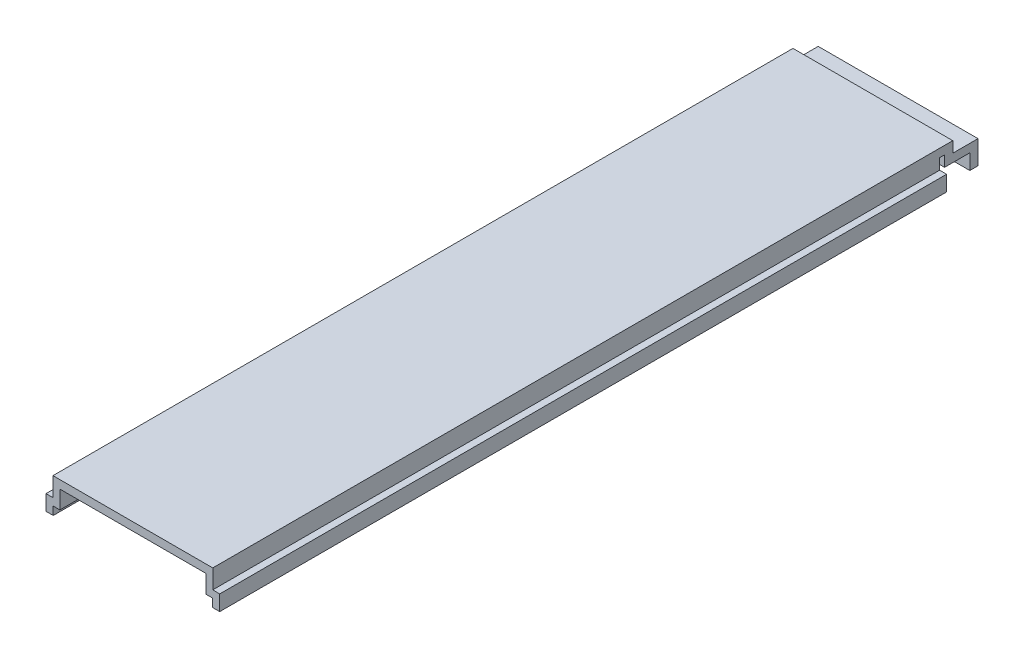
ISO-10303-21;
HEADER;
FILE_DESCRIPTION(('STEP AP214'),'2;1');
FILE_NAME('part.step','',(''),(''),'','','');
FILE_SCHEMA(('AUTOMOTIVE_DESIGN { 1 0 10303 214 1 1 1 1 }'));
ENDSEC;
DATA;
#1=APPLICATION_CONTEXT('core data for automotive mechanical design processes');
#2=APPLICATION_PROTOCOL_DEFINITION('international standard','automotive_design',2000,#1);
#3=PRODUCT_CONTEXT('',#1,'mechanical');
#4=PRODUCT('Part','Part','',(#3));
#5=PRODUCT_RELATED_PRODUCT_CATEGORY('part','',(#4));
#6=PRODUCT_DEFINITION_FORMATION('','',#4);
#7=PRODUCT_DEFINITION_CONTEXT('part definition',#1,'design');
#8=PRODUCT_DEFINITION('design','',#6,#7);
#9=PRODUCT_DEFINITION_SHAPE('','',#8);
#10=(LENGTH_UNIT() NAMED_UNIT(*) SI_UNIT(.MILLI.,.METRE.));
#11=(NAMED_UNIT(*) PLANE_ANGLE_UNIT() SI_UNIT($,.RADIAN.));
#12=(NAMED_UNIT(*) SI_UNIT($,.STERADIAN.) SOLID_ANGLE_UNIT());
#13=UNCERTAINTY_MEASURE_WITH_UNIT(LENGTH_MEASURE(1.E-05),#10,'distance_accuracy_value','');
#14=(GEOMETRIC_REPRESENTATION_CONTEXT(3) GLOBAL_UNCERTAINTY_ASSIGNED_CONTEXT((#13)) GLOBAL_UNIT_ASSIGNED_CONTEXT((#10,
#11,#12)) REPRESENTATION_CONTEXT('',''));
#15=CARTESIAN_POINT('',(0.,0.,0.));
#16=DIRECTION('',(0.,0.,1.));
#17=DIRECTION('',(1.,0.,0.));
#18=AXIS2_PLACEMENT_3D('',#15,#16,#17);
#19=CARTESIAN_POINT('',(0.,0.,0.));
#20=DIRECTION('',(0.,0.,-1.));
#21=DIRECTION('',(-1.,0.,0.));
#22=AXIS2_PLACEMENT_3D('',#19,#20,#21);
#23=PLANE('',#22);
#24=DIRECTION('',(-1.,0.,0.));
#25=VECTOR('',#24,1.);
#26=CARTESIAN_POINT('',(79.6383872683328,20.5122045716546,0.));
#27=LINE('',#26,#25);
#28=CARTESIAN_POINT('',(59.64,20.5122045716546,0.));
#29=VERTEX_POINT('',#28);
#30=CARTESIAN_POINT('',(56.94,20.5122045716546,0.));
#31=VERTEX_POINT('',#30);
#32=EDGE_CURVE('E47',#29,#31,#27,.T.);
#33=ORIENTED_EDGE('',*,*,#32,.F.);
#34=DIRECTION('',(0.,1.,0.));
#35=VECTOR('',#34,1.);
#36=CARTESIAN_POINT('',(59.64,23.6872045716546,0.));
#37=LINE('',#36,#35);
#38=CARTESIAN_POINT('',(59.64,16.298774948689,0.));
#39=VERTEX_POINT('',#38);
#40=EDGE_CURVE('E212',#39,#29,#37,.T.);
#41=ORIENTED_EDGE('',*,*,#40,.F.);
#42=DIRECTION('',(-1.,0.,0.));
#43=VECTOR('',#42,1.);
#44=CARTESIAN_POINT('',(59.64,16.298774948689,0.));
#45=LINE('',#44,#43);
#46=CARTESIAN_POINT('',(62.34,16.298774948689,0.));
#47=VERTEX_POINT('',#46);
#48=EDGE_CURVE('E114',#47,#39,#45,.T.);
#49=ORIENTED_EDGE('',*,*,#48,.F.);
#50=DIRECTION('',(0.,1.,0.));
#51=VECTOR('',#50,1.);
#52=CARTESIAN_POINT('',(62.34,16.298774948689,0.));
#53=LINE('',#52,#51);
#54=CARTESIAN_POINT('',(62.34,10.3372045716546,0.));
#55=VERTEX_POINT('',#54);
#56=EDGE_CURVE('E209',#55,#47,#53,.T.);
#57=ORIENTED_EDGE('',*,*,#56,.F.);
#58=DIRECTION('',(1.,0.,0.));
#59=VECTOR('',#58,1.);
#60=CARTESIAN_POINT('',(59.54,10.3372045716546,0.));
#61=LINE('',#60,#59);
#62=CARTESIAN_POINT('',(59.54,10.3372045716546,0.));
#63=VERTEX_POINT('',#62);
#64=EDGE_CURVE('E207',#63,#55,#61,.T.);
#65=ORIENTED_EDGE('',*,*,#64,.F.);
#66=DIRECTION('',(0.,-1.,0.));
#67=VECTOR('',#66,1.);
#68=CARTESIAN_POINT('',(59.54,13.5122045716546,0.));
#69=LINE('',#68,#67);
#70=CARTESIAN_POINT('',(59.54,13.5122045716546,0.));
#71=VERTEX_POINT('',#70);
#72=EDGE_CURVE('E205',#71,#63,#69,.T.);
#73=ORIENTED_EDGE('',*,*,#72,.F.);
#74=DIRECTION('',(1.,0.,0.));
#75=VECTOR('',#74,1.);
#76=CARTESIAN_POINT('',(56.94,13.5122045716546,0.));
#77=LINE('',#76,#75);
#78=CARTESIAN_POINT('',(56.94,13.5122045716546,0.));
#79=VERTEX_POINT('',#78);
#80=EDGE_CURVE('E203',#79,#71,#77,.T.);
#81=ORIENTED_EDGE('',*,*,#80,.F.);
#82=DIRECTION('',(0.,-1.,0.));
#83=VECTOR('',#82,1.);
#84=CARTESIAN_POINT('',(56.94,20.5122045716546,0.));
#85=LINE('',#84,#83);
#86=EDGE_CURVE('E201',#31,#79,#85,.T.);
#87=ORIENTED_EDGE('',*,*,#86,.F.);
#88=EDGE_LOOP('',(#33,#41,#49,#57,#65,#73,#81,#87));
#89=FACE_BOUND('',#88,.T.);
#90=ADVANCED_FACE('F37',(#89),#23,.T.);
#91=CARTESIAN_POINT('',(-2.36000000000002,23.6872045716546,282.));
#92=DIRECTION('',(1.,0.,0.));
#93=DIRECTION('',(0.,1.,0.));
#94=AXIS2_PLACEMENT_3D('',#91,#92,#93);
#95=PLANE('',#94);
#96=DIRECTION('',(0.,0.,-1.));
#97=VECTOR('',#96,1.);
#98=CARTESIAN_POINT('',(-2.36000000000002,23.6872045716546,282.));
#99=LINE('',#98,#97);
#100=CARTESIAN_POINT('',(-2.36000000000002,23.6872045716546,282.));
#101=VERTEX_POINT('',#100);
#102=CARTESIAN_POINT('',(-2.36000000000002,23.6872045716546,-5.1));
#103=VERTEX_POINT('',#102);
#104=EDGE_CURVE('E181',#101,#103,#99,.T.);
#105=ORIENTED_EDGE('',*,*,#104,.T.);
#106=DIRECTION('',(0.,-1.,0.));
#107=VECTOR('',#106,1.);
#108=CARTESIAN_POINT('',(-2.36000000000002,23.6872045716546,-5.1));
#109=LINE('',#108,#107);
#110=CARTESIAN_POINT('',(-2.36000000000002,19.473774948689,-5.1));
#111=VERTEX_POINT('',#110);
#112=EDGE_CURVE('E322',#103,#111,#109,.T.);
#113=ORIENTED_EDGE('',*,*,#112,.T.);
#114=DIRECTION('',(0.,0.,-1.));
#115=VECTOR('',#114,1.);
#116=CARTESIAN_POINT('',(-2.36000000000002,19.473774948689,-5.1));
#117=LINE('',#116,#115);
#118=CARTESIAN_POINT('',(-2.36000000000002,19.473774948689,-14.8900299977608));
#119=VERTEX_POINT('',#118);
#120=EDGE_CURVE('E325',#111,#119,#117,.T.);
#121=ORIENTED_EDGE('',*,*,#120,.T.);
#122=DIRECTION('',(0.,-1.,0.));
#123=VECTOR('',#122,1.);
#124=CARTESIAN_POINT('',(-2.36000000000002,19.473774948689,-14.8900299977608));
#125=LINE('',#124,#123);
#126=CARTESIAN_POINT('',(-2.36000000000002,10.3372045716546,-14.8900299977608));
#127=VERTEX_POINT('',#126);
#128=EDGE_CURVE('E328',#119,#127,#125,.T.);
#129=ORIENTED_EDGE('',*,*,#128,.T.);
#130=DIRECTION('',(0.,0.,1.));
#131=VECTOR('',#130,1.);
#132=CARTESIAN_POINT('',(-2.36000000000002,10.3372045716546,-14.8900299977608));
#133=LINE('',#132,#131);
#134=CARTESIAN_POINT('',(-2.36000000000002,10.3372045716546,-11.7150299977608));
#135=VERTEX_POINT('',#134);
#136=EDGE_CURVE('E331',#127,#135,#133,.T.);
#137=ORIENTED_EDGE('',*,*,#136,.T.);
#138=DIRECTION('',(0.,1.,0.));
#139=VECTOR('',#138,1.);
#140=CARTESIAN_POINT('',(-2.36000000000002,10.3372045716546,-11.7150299977608));
#141=LINE('',#140,#139);
#142=CARTESIAN_POINT('',(-2.36000000000002,16.298774948689,-11.7150299977608));
#143=VERTEX_POINT('',#142);
#144=EDGE_CURVE('E334',#135,#143,#141,.T.);
#145=ORIENTED_EDGE('',*,*,#144,.T.);
#146=DIRECTION('',(0.,0.,1.));
#147=VECTOR('',#146,1.);
#148=CARTESIAN_POINT('',(-2.36000000000002,16.298774948689,-11.7150299977608));
#149=LINE('',#148,#147);
#150=CARTESIAN_POINT('',(-2.36000000000002,16.298774948689,-1.925));
#151=VERTEX_POINT('',#150);
#152=EDGE_CURVE('E337',#143,#151,#149,.T.);
#153=ORIENTED_EDGE('',*,*,#152,.T.);
#154=DIRECTION('',(0.,1.,0.));
#155=VECTOR('',#154,1.);
#156=CARTESIAN_POINT('',(-2.36000000000002,16.298774948689,-1.925));
#157=LINE('',#156,#155);
#158=CARTESIAN_POINT('',(-2.36000000000002,20.5122045716546,-1.925));
#159=VERTEX_POINT('',#158);
#160=EDGE_CURVE('E340',#151,#159,#157,.T.);
#161=ORIENTED_EDGE('',*,*,#160,.T.);
#162=DIRECTION('',(0.,0.,1.));
#163=VECTOR('',#162,1.);
#164=CARTESIAN_POINT('',(-2.36000000000002,20.5122045716546,-1.925));
#165=LINE('',#164,#163);
#166=CARTESIAN_POINT('',(-2.36000000000002,20.5122045716546,0.));
#167=VERTEX_POINT('',#166);
#168=EDGE_CURVE('E262',#159,#167,#165,.T.);
#169=ORIENTED_EDGE('',*,*,#168,.T.);
#170=DIRECTION('',(0.,-1.,0.));
#171=VECTOR('',#170,1.);
#172=CARTESIAN_POINT('',(-2.36000000000002,23.6872045716546,0.));
#173=LINE('',#172,#171);
#174=CARTESIAN_POINT('',(-2.36000000000002,16.298774948689,0.));
#175=VERTEX_POINT('',#174);
#176=EDGE_CURVE('E185',#167,#175,#173,.T.);
#177=ORIENTED_EDGE('',*,*,#176,.T.);
#178=DIRECTION('',(0.,0.,-1.));
#179=VECTOR('',#178,1.);
#180=CARTESIAN_POINT('',(-2.36000000000002,16.298774948689,282.));
#181=LINE('',#180,#179);
#182=CARTESIAN_POINT('',(-2.36000000000002,16.298774948689,282.));
#183=VERTEX_POINT('',#182);
#184=EDGE_CURVE('E41',#183,#175,#181,.T.);
#185=ORIENTED_EDGE('',*,*,#184,.F.);
#186=DIRECTION('',(0.,-1.,0.));
#187=VECTOR('',#186,1.);
#188=CARTESIAN_POINT('',(-2.36000000000002,23.6872045716546,282.));
#189=LINE('',#188,#187);
#190=EDGE_CURVE('E214',#101,#183,#189,.T.);
#191=ORIENTED_EDGE('',*,*,#190,.F.);
#192=EDGE_LOOP('',(#105,#113,#121,#129,#137,#145,#153,#161,#169,#177,#185,#191));
#193=FACE_BOUND('',#192,.T.);
#194=ADVANCED_FACE('F39',(#193),#95,.F.);
#195=CARTESIAN_POINT('',(-2.36000000000002,16.298774948689,282.));
#196=DIRECTION('',(0.,-1.,0.));
#197=DIRECTION('',(0.,0.,-1.));
#198=AXIS2_PLACEMENT_3D('',#195,#196,#197);
#199=PLANE('',#198);
#200=DIRECTION('',(-1.,0.,0.));
#201=VECTOR('',#200,1.);
#202=CARTESIAN_POINT('',(-2.36000000000002,16.298774948689,0.));
#203=LINE('',#202,#201);
#204=CARTESIAN_POINT('',(-5.06000000000002,16.298774948689,0.));
#205=VERTEX_POINT('',#204);
#206=EDGE_CURVE('E187',#175,#205,#203,.T.);
#207=ORIENTED_EDGE('',*,*,#206,.T.);
#208=DIRECTION('',(0.,0.,-1.));
#209=VECTOR('',#208,1.);
#210=CARTESIAN_POINT('',(-5.06000000000002,16.298774948689,282.));
#211=LINE('',#210,#209);
#212=CARTESIAN_POINT('',(-5.06000000000002,16.298774948689,282.));
#213=VERTEX_POINT('',#212);
#214=EDGE_CURVE('E247',#213,#205,#211,.T.);
#215=ORIENTED_EDGE('',*,*,#214,.F.);
#216=DIRECTION('',(-1.,0.,0.));
#217=VECTOR('',#216,1.);
#218=CARTESIAN_POINT('',(-2.36000000000002,16.298774948689,282.));
#219=LINE('',#218,#217);
#220=EDGE_CURVE('E123',#183,#213,#219,.T.);
#221=ORIENTED_EDGE('',*,*,#220,.F.);
#222=ORIENTED_EDGE('',*,*,#184,.T.);
#223=EDGE_LOOP('',(#207,#215,#221,#222));
#224=FACE_BOUND('',#223,.T.);
#225=ADVANCED_FACE('F253',(#224),#199,.F.);
#226=CARTESIAN_POINT('',(-5.06000000000002,16.298774948689,282.));
#227=DIRECTION('',(1.,0.,0.));
#228=DIRECTION('',(0.,1.,0.));
#229=AXIS2_PLACEMENT_3D('',#226,#227,#228);
#230=PLANE('',#229);
#231=DIRECTION('',(0.,-1.,0.));
#232=VECTOR('',#231,1.);
#233=CARTESIAN_POINT('',(-5.06000000000002,16.298774948689,0.));
#234=LINE('',#233,#232);
#235=CARTESIAN_POINT('',(-5.06000000000002,10.3372045716546,0.));
#236=VERTEX_POINT('',#235);
#237=EDGE_CURVE('E190',#205,#236,#234,.T.);
#238=ORIENTED_EDGE('',*,*,#237,.T.);
#239=DIRECTION('',(0.,0.,-1.));
#240=VECTOR('',#239,1.);
#241=CARTESIAN_POINT('',(-5.06000000000002,10.3372045716546,282.));
#242=LINE('',#241,#240);
#243=CARTESIAN_POINT('',(-5.06000000000002,10.3372045716546,282.));
#244=VERTEX_POINT('',#243);
#245=EDGE_CURVE('E245',#244,#236,#242,.T.);
#246=ORIENTED_EDGE('',*,*,#245,.F.);
#247=DIRECTION('',(0.,-1.,0.));
#248=VECTOR('',#247,1.);
#249=CARTESIAN_POINT('',(-5.06000000000002,16.298774948689,282.));
#250=LINE('',#249,#248);
#251=EDGE_CURVE('E276',#213,#244,#250,.T.);
#252=ORIENTED_EDGE('',*,*,#251,.F.);
#253=ORIENTED_EDGE('',*,*,#214,.T.);
#254=EDGE_LOOP('',(#238,#246,#252,#253));
#255=FACE_BOUND('',#254,.T.);
#256=ADVANCED_FACE('F268',(#255),#230,.F.);
#257=CARTESIAN_POINT('',(-5.06000000000002,10.3372045716546,282.));
#258=DIRECTION('',(0.,1.,0.));
#259=DIRECTION('',(0.,0.,1.));
#260=AXIS2_PLACEMENT_3D('',#257,#258,#259);
#261=PLANE('',#260);
#262=DIRECTION('',(1.,0.,0.));
#263=VECTOR('',#262,1.);
#264=CARTESIAN_POINT('',(-5.06000000000002,10.3372045716546,0.));
#265=LINE('',#264,#263);
#266=CARTESIAN_POINT('',(-2.26000000000002,10.3372045716546,0.));
#267=VERTEX_POINT('',#266);
#268=EDGE_CURVE('E192',#236,#267,#265,.T.);
#269=ORIENTED_EDGE('',*,*,#268,.T.);
#270=DIRECTION('',(0.,0.,-1.));
#271=VECTOR('',#270,1.);
#272=CARTESIAN_POINT('',(-2.26000000000002,10.3372045716546,282.));
#273=LINE('',#272,#271);
#274=CARTESIAN_POINT('',(-2.26000000000002,10.3372045716546,282.));
#275=VERTEX_POINT('',#274);
#276=EDGE_CURVE('E242',#275,#267,#273,.T.);
#277=ORIENTED_EDGE('',*,*,#276,.F.);
#278=DIRECTION('',(1.,0.,0.));
#279=VECTOR('',#278,1.);
#280=CARTESIAN_POINT('',(-5.06000000000002,10.3372045716546,282.));
#281=LINE('',#280,#279);
#282=EDGE_CURVE('E273',#244,#275,#281,.T.);
#283=ORIENTED_EDGE('',*,*,#282,.F.);
#284=ORIENTED_EDGE('',*,*,#245,.T.);
#285=EDGE_LOOP('',(#269,#277,#283,#284));
#286=FACE_BOUND('',#285,.T.);
#287=ADVANCED_FACE('F271',(#286),#261,.F.);
#288=CARTESIAN_POINT('',(-2.26000000000002,10.3372045716546,282.));
#289=DIRECTION('',(-1.,0.,0.));
#290=DIRECTION('',(0.,0.,1.));
#291=AXIS2_PLACEMENT_3D('',#288,#289,#290);
#292=PLANE('',#291);
#293=DIRECTION('',(0.,1.,0.));
#294=VECTOR('',#293,1.);
#295=CARTESIAN_POINT('',(-2.26000000000002,10.3372045716546,0.));
#296=LINE('',#295,#294);
#297=CARTESIAN_POINT('',(-2.26000000000002,13.5122045716546,0.));
#298=VERTEX_POINT('',#297);
#299=EDGE_CURVE('E194',#267,#298,#296,.T.);
#300=ORIENTED_EDGE('',*,*,#299,.T.);
#301=DIRECTION('',(0.,0.,-1.));
#302=VECTOR('',#301,1.);
#303=CARTESIAN_POINT('',(-2.26000000000002,13.5122045716546,282.));
#304=LINE('',#303,#302);
#305=CARTESIAN_POINT('',(-2.26000000000002,13.5122045716546,282.));
#306=VERTEX_POINT('',#305);
#307=EDGE_CURVE('E239',#306,#298,#304,.T.);
#308=ORIENTED_EDGE('',*,*,#307,.F.);
#309=DIRECTION('',(0.,1.,0.));
#310=VECTOR('',#309,1.);
#311=CARTESIAN_POINT('',(-2.26000000000002,10.3372045716546,282.));
#312=LINE('',#311,#310);
#313=EDGE_CURVE('E275',#275,#306,#312,.T.);
#314=ORIENTED_EDGE('',*,*,#313,.F.);
#315=ORIENTED_EDGE('',*,*,#276,.T.);
#316=EDGE_LOOP('',(#300,#308,#314,#315));
#317=FACE_BOUND('',#316,.T.);
#318=ADVANCED_FACE('F454',(#317),#292,.F.);
#319=CARTESIAN_POINT('',(-2.26000000000002,13.5122045716546,282.));
#320=DIRECTION('',(0.,1.,0.));
#321=DIRECTION('',(0.,0.,1.));
#322=AXIS2_PLACEMENT_3D('',#319,#320,#321);
#323=PLANE('',#322);
#324=DIRECTION('',(1.,0.,0.));
#325=VECTOR('',#324,1.);
#326=CARTESIAN_POINT('',(-2.26000000000002,13.5122045716546,0.));
#327=LINE('',#326,#325);
#328=CARTESIAN_POINT('',(0.339999999999983,13.5122045716546,0.));
#329=VERTEX_POINT('',#328);
#330=EDGE_CURVE('E196',#298,#329,#327,.T.);
#331=ORIENTED_EDGE('',*,*,#330,.T.);
#332=DIRECTION('',(0.,0.,-1.));
#333=VECTOR('',#332,1.);
#334=CARTESIAN_POINT('',(0.339999999999983,13.5122045716546,282.));
#335=LINE('',#334,#333);
#336=CARTESIAN_POINT('',(0.339999999999983,13.5122045716546,282.));
#337=VERTEX_POINT('',#336);
#338=EDGE_CURVE('E236',#337,#329,#335,.T.);
#339=ORIENTED_EDGE('',*,*,#338,.F.);
#340=DIRECTION('',(1.,0.,0.));
#341=VECTOR('',#340,1.);
#342=CARTESIAN_POINT('',(-2.26000000000002,13.5122045716546,282.));
#343=LINE('',#342,#341);
#344=EDGE_CURVE('E278',#306,#337,#343,.T.);
#345=ORIENTED_EDGE('',*,*,#344,.F.);
#346=ORIENTED_EDGE('',*,*,#307,.T.);
#347=EDGE_LOOP('',(#331,#339,#345,#346));
#348=FACE_BOUND('',#347,.T.);
#349=ADVANCED_FACE('F451',(#348),#323,.F.);
#350=CARTESIAN_POINT('',(0.339999999999983,13.5122045716546,282.));
#351=DIRECTION('',(-1.,0.,0.));
#352=DIRECTION('',(0.,-1.,0.));
#353=AXIS2_PLACEMENT_3D('',#350,#351,#352);
#354=PLANE('',#353);
#355=DIRECTION('',(0.,1.,0.));
#356=VECTOR('',#355,1.);
#357=CARTESIAN_POINT('',(0.339999999999983,13.5122045716546,0.));
#358=LINE('',#357,#356);
#359=CARTESIAN_POINT('',(0.339999999999983,20.5122045716546,0.));
#360=VERTEX_POINT('',#359);
#361=EDGE_CURVE('E198',#329,#360,#358,.T.);
#362=ORIENTED_EDGE('',*,*,#361,.T.);
#363=DIRECTION('',(0.,0.,-1.));
#364=VECTOR('',#363,1.);
#365=CARTESIAN_POINT('',(0.339999999999983,20.5122045716546,282.));
#366=LINE('',#365,#364);
#367=CARTESIAN_POINT('',(0.339999999999983,20.5122045716546,282.));
#368=VERTEX_POINT('',#367);
#369=EDGE_CURVE('E233',#368,#360,#366,.T.);
#370=ORIENTED_EDGE('',*,*,#369,.F.);
#371=DIRECTION('',(0.,1.,0.));
#372=VECTOR('',#371,1.);
#373=CARTESIAN_POINT('',(0.339999999999983,13.5122045716546,282.));
#374=LINE('',#373,#372);
#375=EDGE_CURVE('E284',#337,#368,#374,.T.);
#376=ORIENTED_EDGE('',*,*,#375,.F.);
#377=ORIENTED_EDGE('',*,*,#338,.T.);
#378=EDGE_LOOP('',(#362,#370,#376,#377));
#379=FACE_BOUND('',#378,.T.);
#380=ADVANCED_FACE('F446',(#379),#354,.F.);
#381=CARTESIAN_POINT('',(0.339999999999983,20.5122045716546,282.));
#382=DIRECTION('',(0.,1.,0.));
#383=DIRECTION('',(0.,0.,1.));
#384=AXIS2_PLACEMENT_3D('',#381,#382,#383);
#385=PLANE('',#384);
#386=ORIENTED_EDGE('',*,*,#369,.T.);
#387=EDGE_CURVE('E11',#360,#167,#27,.T.);
#388=ORIENTED_EDGE('',*,*,#387,.T.);
#389=ORIENTED_EDGE('',*,*,#168,.F.);
#390=DIRECTION('',(-1.,0.,0.));
#391=VECTOR('',#390,1.);
#392=CARTESIAN_POINT('',(79.6383872683328,20.5122045716546,-1.925));
#393=LINE('',#392,#391);
#394=CARTESIAN_POINT('',(59.64,20.5122045716546,-1.925));
#395=VERTEX_POINT('',#394);
#396=EDGE_CURVE('E315',#395,#159,#393,.T.);
#397=ORIENTED_EDGE('',*,*,#396,.F.);
#398=DIRECTION('',(0.,0.,-1.));
#399=VECTOR('',#398,1.);
#400=CARTESIAN_POINT('',(59.64,20.5122045716546,-1.925));
#401=LINE('',#400,#399);
#402=EDGE_CURVE('E188',#29,#395,#401,.T.);
#403=ORIENTED_EDGE('',*,*,#402,.F.);
#404=ORIENTED_EDGE('',*,*,#32,.T.);
#405=DIRECTION('',(0.,0.,-1.));
#406=VECTOR('',#405,1.);
#407=CARTESIAN_POINT('',(56.94,20.5122045716546,282.));
#408=LINE('',#407,#406);
#409=CARTESIAN_POINT('',(56.94,20.5122045716546,282.));
#410=VERTEX_POINT('',#409);
#411=EDGE_CURVE('E231',#410,#31,#408,.T.);
#412=ORIENTED_EDGE('',*,*,#411,.F.);
#413=DIRECTION('',(1.,0.,0.));
#414=VECTOR('',#413,1.);
#415=CARTESIAN_POINT('',(0.339999999999983,20.5122045716546,282.));
#416=LINE('',#415,#414);
#417=EDGE_CURVE('E286',#368,#410,#416,.T.);
#418=ORIENTED_EDGE('',*,*,#417,.F.);
#419=EDGE_LOOP('',(#386,#388,#389,#397,#403,#404,#412,#418));
#420=FACE_BOUND('',#419,.T.);
#421=ADVANCED_FACE('F312',(#420),#385,.F.);
#422=CARTESIAN_POINT('',(56.94,20.5122045716546,282.));
#423=DIRECTION('',(1.,0.,0.));
#424=DIRECTION('',(0.,0.,-1.));
#425=AXIS2_PLACEMENT_3D('',#422,#423,#424);
#426=PLANE('',#425);
#427=ORIENTED_EDGE('',*,*,#86,.T.);
#428=DIRECTION('',(0.,0.,-1.));
#429=VECTOR('',#428,1.);
#430=CARTESIAN_POINT('',(56.94,13.5122045716546,282.));
#431=LINE('',#430,#429);
#432=CARTESIAN_POINT('',(56.94,13.5122045716546,282.));
#433=VERTEX_POINT('',#432);
#434=EDGE_CURVE('E228',#433,#79,#431,.T.);
#435=ORIENTED_EDGE('',*,*,#434,.F.);
#436=DIRECTION('',(0.,-1.,0.));
#437=VECTOR('',#436,1.);
#438=CARTESIAN_POINT('',(56.94,20.5122045716546,282.));
#439=LINE('',#438,#437);
#440=EDGE_CURVE('E288',#410,#433,#439,.T.);
#441=ORIENTED_EDGE('',*,*,#440,.F.);
#442=ORIENTED_EDGE('',*,*,#411,.T.);
#443=EDGE_LOOP('',(#427,#435,#441,#442));
#444=FACE_BOUND('',#443,.T.);
#445=ADVANCED_FACE('F458',(#444),#426,.F.);
#446=CARTESIAN_POINT('',(56.94,13.5122045716546,282.));
#447=DIRECTION('',(0.,1.,0.));
#448=DIRECTION('',(0.,0.,1.));
#449=AXIS2_PLACEMENT_3D('',#446,#447,#448);
#450=PLANE('',#449);
#451=ORIENTED_EDGE('',*,*,#80,.T.);
#452=DIRECTION('',(0.,0.,-1.));
#453=VECTOR('',#452,1.);
#454=CARTESIAN_POINT('',(59.54,13.5122045716546,282.));
#455=LINE('',#454,#453);
#456=CARTESIAN_POINT('',(59.54,13.5122045716546,282.));
#457=VERTEX_POINT('',#456);
#458=EDGE_CURVE('E225',#457,#71,#455,.T.);
#459=ORIENTED_EDGE('',*,*,#458,.F.);
#460=DIRECTION('',(1.,0.,0.));
#461=VECTOR('',#460,1.);
#462=CARTESIAN_POINT('',(56.94,13.5122045716546,282.));
#463=LINE('',#462,#461);
#464=EDGE_CURVE('E290',#433,#457,#463,.T.);
#465=ORIENTED_EDGE('',*,*,#464,.F.);
#466=ORIENTED_EDGE('',*,*,#434,.T.);
#467=EDGE_LOOP('',(#451,#459,#465,#466));
#468=FACE_BOUND('',#467,.T.);
#469=ADVANCED_FACE('F463',(#468),#450,.F.);
#470=CARTESIAN_POINT('',(59.54,13.5122045716546,282.));
#471=DIRECTION('',(1.,0.,0.));
#472=DIRECTION('',(0.,0.,-1.));
#473=AXIS2_PLACEMENT_3D('',#470,#471,#472);
#474=PLANE('',#473);
#475=ORIENTED_EDGE('',*,*,#72,.T.);
#476=DIRECTION('',(0.,0.,-1.));
#477=VECTOR('',#476,1.);
#478=CARTESIAN_POINT('',(59.54,10.3372045716546,282.));
#479=LINE('',#478,#477);
#480=CARTESIAN_POINT('',(59.54,10.3372045716546,282.));
#481=VERTEX_POINT('',#480);
#482=EDGE_CURVE('E222',#481,#63,#479,.T.);
#483=ORIENTED_EDGE('',*,*,#482,.F.);
#484=DIRECTION('',(0.,-1.,0.));
#485=VECTOR('',#484,1.);
#486=CARTESIAN_POINT('',(59.54,13.5122045716546,282.));
#487=LINE('',#486,#485);
#488=EDGE_CURVE('E292',#457,#481,#487,.T.);
#489=ORIENTED_EDGE('',*,*,#488,.F.);
#490=ORIENTED_EDGE('',*,*,#458,.T.);
#491=EDGE_LOOP('',(#475,#483,#489,#490));
#492=FACE_BOUND('',#491,.T.);
#493=ADVANCED_FACE('F466',(#492),#474,.F.);
#494=CARTESIAN_POINT('',(59.54,10.3372045716546,282.));
#495=DIRECTION('',(0.,1.,0.));
#496=DIRECTION('',(0.,0.,1.));
#497=AXIS2_PLACEMENT_3D('',#494,#495,#496);
#498=PLANE('',#497);
#499=ORIENTED_EDGE('',*,*,#64,.T.);
#500=DIRECTION('',(0.,0.,-1.));
#501=VECTOR('',#500,1.);
#502=CARTESIAN_POINT('',(62.34,10.3372045716546,282.));
#503=LINE('',#502,#501);
#504=CARTESIAN_POINT('',(62.34,10.3372045716546,282.));
#505=VERTEX_POINT('',#504);
#506=EDGE_CURVE('E219',#505,#55,#503,.T.);
#507=ORIENTED_EDGE('',*,*,#506,.F.);
#508=DIRECTION('',(1.,0.,0.));
#509=VECTOR('',#508,1.);
#510=CARTESIAN_POINT('',(59.54,10.3372045716546,282.));
#511=LINE('',#510,#509);
#512=EDGE_CURVE('E294',#481,#505,#511,.T.);
#513=ORIENTED_EDGE('',*,*,#512,.F.);
#514=ORIENTED_EDGE('',*,*,#482,.T.);
#515=EDGE_LOOP('',(#499,#507,#513,#514));
#516=FACE_BOUND('',#515,.T.);
#517=ADVANCED_FACE('F300',(#516),#498,.F.);
#518=CARTESIAN_POINT('',(62.34,16.298774948689,282.));
#519=DIRECTION('',(-1.,0.,0.));
#520=DIRECTION('',(0.,0.,1.));
#521=AXIS2_PLACEMENT_3D('',#518,#519,#520);
#522=PLANE('',#521);
#523=ORIENTED_EDGE('',*,*,#56,.T.);
#524=DIRECTION('',(0.,0.,-1.));
#525=VECTOR('',#524,1.);
#526=CARTESIAN_POINT('',(62.34,16.298774948689,282.));
#527=LINE('',#526,#525);
#528=CARTESIAN_POINT('',(62.34,16.298774948689,282.));
#529=VERTEX_POINT('',#528);
#530=EDGE_CURVE('E174',#529,#47,#527,.T.);
#531=ORIENTED_EDGE('',*,*,#530,.F.);
#532=DIRECTION('',(0.,1.,0.));
#533=VECTOR('',#532,1.);
#534=CARTESIAN_POINT('',(62.34,16.298774948689,282.));
#535=LINE('',#534,#533);
#536=EDGE_CURVE('E168',#505,#529,#535,.T.);
#537=ORIENTED_EDGE('',*,*,#536,.F.);
#538=ORIENTED_EDGE('',*,*,#506,.T.);
#539=EDGE_LOOP('',(#523,#531,#537,#538));
#540=FACE_BOUND('',#539,.T.);
#541=ADVANCED_FACE('F304',(#540),#522,.F.);
#542=CARTESIAN_POINT('',(59.64,16.298774948689,282.));
#543=DIRECTION('',(0.,-1.,0.));
#544=DIRECTION('',(0.,0.,-1.));
#545=AXIS2_PLACEMENT_3D('',#542,#543,#544);
#546=PLANE('',#545);
#547=ORIENTED_EDGE('',*,*,#48,.T.);
#548=DIRECTION('',(0.,0.,-1.));
#549=VECTOR('',#548,1.);
#550=CARTESIAN_POINT('',(59.64,16.298774948689,282.));
#551=LINE('',#550,#549);
#552=CARTESIAN_POINT('',(59.64,16.298774948689,282.));
#553=VERTEX_POINT('',#552);
#554=EDGE_CURVE('E171',#553,#39,#551,.T.);
#555=ORIENTED_EDGE('',*,*,#554,.F.);
#556=DIRECTION('',(-1.,0.,0.));
#557=VECTOR('',#556,1.);
#558=CARTESIAN_POINT('',(59.64,16.298774948689,282.));
#559=LINE('',#558,#557);
#560=EDGE_CURVE('E162',#529,#553,#559,.T.);
#561=ORIENTED_EDGE('',*,*,#560,.F.);
#562=ORIENTED_EDGE('',*,*,#530,.T.);
#563=EDGE_LOOP('',(#547,#555,#561,#562));
#564=FACE_BOUND('',#563,.T.);
#565=ADVANCED_FACE('F172',(#564),#546,.F.);
#566=CARTESIAN_POINT('',(59.64,23.6872045716546,282.));
#567=DIRECTION('',(-1.,0.,0.));
#568=DIRECTION('',(0.,0.,1.));
#569=AXIS2_PLACEMENT_3D('',#566,#567,#568);
#570=PLANE('',#569);
#571=ORIENTED_EDGE('',*,*,#40,.T.);
#572=ORIENTED_EDGE('',*,*,#402,.T.);
#573=DIRECTION('',(0.,-1.,0.));
#574=VECTOR('',#573,1.);
#575=CARTESIAN_POINT('',(59.64,16.298774948689,-1.925));
#576=LINE('',#575,#574);
#577=CARTESIAN_POINT('',(59.64,16.298774948689,-1.925));
#578=VERTEX_POINT('',#577);
#579=EDGE_CURVE('E316',#395,#578,#576,.T.);
#580=ORIENTED_EDGE('',*,*,#579,.T.);
#581=DIRECTION('',(0.,0.,-1.));
#582=VECTOR('',#581,1.);
#583=CARTESIAN_POINT('',(59.64,16.298774948689,-11.7150299977608));
#584=LINE('',#583,#582);
#585=CARTESIAN_POINT('',(59.64,16.298774948689,-11.7150299977608));
#586=VERTEX_POINT('',#585);
#587=EDGE_CURVE('E318',#578,#586,#584,.T.);
#588=ORIENTED_EDGE('',*,*,#587,.T.);
#589=DIRECTION('',(0.,-1.,0.));
#590=VECTOR('',#589,1.);
#591=CARTESIAN_POINT('',(59.64,10.3372045716546,-11.7150299977608));
#592=LINE('',#591,#590);
#593=CARTESIAN_POINT('',(59.64,10.3372045716546,-11.7150299977608));
#594=VERTEX_POINT('',#593);
#595=EDGE_CURVE('E434',#586,#594,#592,.T.);
#596=ORIENTED_EDGE('',*,*,#595,.T.);
#597=DIRECTION('',(0.,0.,-1.));
#598=VECTOR('',#597,1.);
#599=CARTESIAN_POINT('',(59.64,10.3372045716546,-14.8900299977608));
#600=LINE('',#599,#598);
#601=CARTESIAN_POINT('',(59.64,10.3372045716546,-14.8900299977608));
#602=VERTEX_POINT('',#601);
#603=EDGE_CURVE('E428',#594,#602,#600,.T.);
#604=ORIENTED_EDGE('',*,*,#603,.T.);
#605=DIRECTION('',(0.,1.,0.));
#606=VECTOR('',#605,1.);
#607=CARTESIAN_POINT('',(59.64,19.473774948689,-14.8900299977608));
#608=LINE('',#607,#606);
#609=CARTESIAN_POINT('',(59.64,19.473774948689,-14.8900299977608));
#610=VERTEX_POINT('',#609);
#611=EDGE_CURVE('E410',#602,#610,#608,.T.);
#612=ORIENTED_EDGE('',*,*,#611,.T.);
#613=DIRECTION('',(0.,0.,1.));
#614=VECTOR('',#613,1.);
#615=CARTESIAN_POINT('',(59.64,19.473774948689,-5.1));
#616=LINE('',#615,#614);
#617=CARTESIAN_POINT('',(59.64,19.473774948689,-5.1));
#618=VERTEX_POINT('',#617);
#619=EDGE_CURVE('E412',#610,#618,#616,.T.);
#620=ORIENTED_EDGE('',*,*,#619,.T.);
#621=DIRECTION('',(0.,1.,0.));
#622=VECTOR('',#621,1.);
#623=CARTESIAN_POINT('',(59.64,23.6872045716546,-5.1));
#624=LINE('',#623,#622);
#625=CARTESIAN_POINT('',(59.64,23.6872045716546,-5.1));
#626=VERTEX_POINT('',#625);
#627=EDGE_CURVE('E344',#618,#626,#624,.T.);
#628=ORIENTED_EDGE('',*,*,#627,.T.);
#629=DIRECTION('',(0.,0.,-1.));
#630=VECTOR('',#629,1.);
#631=CARTESIAN_POINT('',(59.64,23.6872045716546,282.));
#632=LINE('',#631,#630);
#633=CARTESIAN_POINT('',(59.64,23.6872045716546,282.));
#634=VERTEX_POINT('',#633);
#635=EDGE_CURVE('E175',#634,#626,#632,.T.);
#636=ORIENTED_EDGE('',*,*,#635,.F.);
#637=DIRECTION('',(0.,1.,0.));
#638=VECTOR('',#637,1.);
#639=CARTESIAN_POINT('',(59.64,23.6872045716546,282.));
#640=LINE('',#639,#638);
#641=EDGE_CURVE('E165',#553,#634,#640,.T.);
#642=ORIENTED_EDGE('',*,*,#641,.F.);
#643=ORIENTED_EDGE('',*,*,#554,.T.);
#644=EDGE_LOOP('',(#571,#572,#580,#588,#596,#604,#612,#620,#628,#636,#642,#643));
#645=FACE_BOUND('',#644,.T.);
#646=ADVANCED_FACE('F177',(#645),#570,.F.);
#647=CARTESIAN_POINT('',(-2.36000000000002,23.6872045716546,282.));
#648=DIRECTION('',(0.,-1.,0.));
#649=DIRECTION('',(0.,0.,-1.));
#650=AXIS2_PLACEMENT_3D('',#647,#648,#649);
#651=PLANE('',#650);
#652=ORIENTED_EDGE('',*,*,#635,.T.);
#653=DIRECTION('',(-1.,0.,0.));
#654=VECTOR('',#653,1.);
#655=CARTESIAN_POINT('',(79.6383872683328,23.6872045716546,-5.1));
#656=LINE('',#655,#654);
#657=EDGE_CURVE('E342',#626,#103,#656,.T.);
#658=ORIENTED_EDGE('',*,*,#657,.T.);
#659=ORIENTED_EDGE('',*,*,#104,.F.);
#660=DIRECTION('',(-1.,0.,0.));
#661=VECTOR('',#660,1.);
#662=CARTESIAN_POINT('',(-2.36000000000002,23.6872045716546,282.));
#663=LINE('',#662,#661);
#664=EDGE_CURVE('E62',#634,#101,#663,.T.);
#665=ORIENTED_EDGE('',*,*,#664,.F.);
#666=EDGE_LOOP('',(#652,#658,#659,#665));
#667=FACE_BOUND('',#666,.T.);
#668=ADVANCED_FACE('F370',(#667),#651,.F.);
#669=CARTESIAN_POINT('',(0.,0.,282.));
#670=DIRECTION('',(0.,0.,-1.));
#671=DIRECTION('',(-1.,0.,0.));
#672=AXIS2_PLACEMENT_3D('',#669,#670,#671);
#673=PLANE('',#672);
#674=ORIENTED_EDGE('',*,*,#190,.T.);
#675=ORIENTED_EDGE('',*,*,#220,.T.);
#676=ORIENTED_EDGE('',*,*,#251,.T.);
#677=ORIENTED_EDGE('',*,*,#282,.T.);
#678=ORIENTED_EDGE('',*,*,#313,.T.);
#679=ORIENTED_EDGE('',*,*,#344,.T.);
#680=ORIENTED_EDGE('',*,*,#375,.T.);
#681=ORIENTED_EDGE('',*,*,#417,.T.);
#682=ORIENTED_EDGE('',*,*,#440,.T.);
#683=ORIENTED_EDGE('',*,*,#464,.T.);
#684=ORIENTED_EDGE('',*,*,#488,.T.);
#685=ORIENTED_EDGE('',*,*,#512,.T.);
#686=ORIENTED_EDGE('',*,*,#536,.T.);
#687=ORIENTED_EDGE('',*,*,#560,.T.);
#688=ORIENTED_EDGE('',*,*,#641,.T.);
#689=ORIENTED_EDGE('',*,*,#664,.T.);
#690=EDGE_LOOP('',(#674,#675,#676,#677,#678,#679,#680,#681,#682,#683,#684,#685,#686,#687,#688,#689));
#691=FACE_BOUND('',#690,.T.);
#692=ADVANCED_FACE('F163',(#691),#673,.F.);
#693=ORIENTED_EDGE('',*,*,#387,.F.);
#694=ORIENTED_EDGE('',*,*,#361,.F.);
#695=ORIENTED_EDGE('',*,*,#330,.F.);
#696=ORIENTED_EDGE('',*,*,#299,.F.);
#697=ORIENTED_EDGE('',*,*,#268,.F.);
#698=ORIENTED_EDGE('',*,*,#237,.F.);
#699=ORIENTED_EDGE('',*,*,#206,.F.);
#700=ORIENTED_EDGE('',*,*,#176,.F.);
#701=EDGE_LOOP('',(#693,#694,#695,#696,#697,#698,#699,#700));
#702=FACE_BOUND('',#701,.T.);
#703=ADVANCED_FACE('F264',(#702),#23,.T.);
#704=CARTESIAN_POINT('',(79.6383872683328,16.298774948689,-1.925));
#705=DIRECTION('',(0.,0.,1.));
#706=DIRECTION('',(1.,0.,0.));
#707=AXIS2_PLACEMENT_3D('',#704,#705,#706);
#708=PLANE('',#707);
#709=ORIENTED_EDGE('',*,*,#579,.F.);
#710=ORIENTED_EDGE('',*,*,#396,.T.);
#711=ORIENTED_EDGE('',*,*,#160,.F.);
#712=DIRECTION('',(-1.,0.,0.));
#713=VECTOR('',#712,1.);
#714=CARTESIAN_POINT('',(79.6383872683328,16.298774948689,-1.925));
#715=LINE('',#714,#713);
#716=EDGE_CURVE('E346',#578,#151,#715,.T.);
#717=ORIENTED_EDGE('',*,*,#716,.F.);
#718=EDGE_LOOP('',(#709,#710,#711,#717));
#719=FACE_BOUND('',#718,.T.);
#720=ADVANCED_FACE('F483',(#719),#708,.T.);
#721=CARTESIAN_POINT('',(79.6383872683328,16.298774948689,-11.7150299977608));
#722=DIRECTION('',(0.,-1.,0.));
#723=DIRECTION('',(1.,0.,0.));
#724=AXIS2_PLACEMENT_3D('',#721,#722,#723);
#725=PLANE('',#724);
#726=ORIENTED_EDGE('',*,*,#587,.F.);
#727=ORIENTED_EDGE('',*,*,#716,.T.);
#728=ORIENTED_EDGE('',*,*,#152,.F.);
#729=DIRECTION('',(-1.,0.,0.));
#730=VECTOR('',#729,1.);
#731=CARTESIAN_POINT('',(79.6383872683328,16.298774948689,-11.7150299977608));
#732=LINE('',#731,#730);
#733=EDGE_CURVE('E349',#586,#143,#732,.T.);
#734=ORIENTED_EDGE('',*,*,#733,.F.);
#735=EDGE_LOOP('',(#726,#727,#728,#734));
#736=FACE_BOUND('',#735,.T.);
#737=ADVANCED_FACE('F437',(#736),#725,.T.);
#738=CARTESIAN_POINT('',(79.6383872683328,10.3372045716546,-11.7150299977608));
#739=DIRECTION('',(0.,0.,1.));
#740=DIRECTION('',(0.,-1.,0.));
#741=AXIS2_PLACEMENT_3D('',#738,#739,#740);
#742=PLANE('',#741);
#743=ORIENTED_EDGE('',*,*,#595,.F.);
#744=ORIENTED_EDGE('',*,*,#733,.T.);
#745=ORIENTED_EDGE('',*,*,#144,.F.);
#746=DIRECTION('',(-1.,0.,0.));
#747=VECTOR('',#746,1.);
#748=CARTESIAN_POINT('',(79.6383872683328,10.3372045716546,-11.7150299977608));
#749=LINE('',#748,#747);
#750=EDGE_CURVE('E352',#594,#135,#749,.T.);
#751=ORIENTED_EDGE('',*,*,#750,.F.);
#752=EDGE_LOOP('',(#743,#744,#745,#751));
#753=FACE_BOUND('',#752,.T.);
#754=ADVANCED_FACE('F431',(#753),#742,.T.);
#755=CARTESIAN_POINT('',(79.6383872683328,10.3372045716546,-14.8900299977608));
#756=DIRECTION('',(0.,-1.,0.));
#757=DIRECTION('',(1.,0.,0.));
#758=AXIS2_PLACEMENT_3D('',#755,#756,#757);
#759=PLANE('',#758);
#760=ORIENTED_EDGE('',*,*,#603,.F.);
#761=ORIENTED_EDGE('',*,*,#750,.T.);
#762=ORIENTED_EDGE('',*,*,#136,.F.);
#763=DIRECTION('',(-1.,0.,0.));
#764=VECTOR('',#763,1.);
#765=CARTESIAN_POINT('',(79.6383872683328,10.3372045716546,-14.8900299977608));
#766=LINE('',#765,#764);
#767=EDGE_CURVE('E355',#602,#127,#766,.T.);
#768=ORIENTED_EDGE('',*,*,#767,.F.);
#769=EDGE_LOOP('',(#760,#761,#762,#768));
#770=FACE_BOUND('',#769,.T.);
#771=ADVANCED_FACE('F426',(#770),#759,.T.);
#772=CARTESIAN_POINT('',(79.6383872683328,19.473774948689,-14.8900299977608));
#773=DIRECTION('',(0.,0.,-1.));
#774=DIRECTION('',(0.,1.,0.));
#775=AXIS2_PLACEMENT_3D('',#772,#773,#774);
#776=PLANE('',#775);
#777=ORIENTED_EDGE('',*,*,#611,.F.);
#778=ORIENTED_EDGE('',*,*,#767,.T.);
#779=ORIENTED_EDGE('',*,*,#128,.F.);
#780=DIRECTION('',(-1.,0.,0.));
#781=VECTOR('',#780,1.);
#782=CARTESIAN_POINT('',(79.6383872683328,19.473774948689,-14.8900299977608));
#783=LINE('',#782,#781);
#784=EDGE_CURVE('E358',#610,#119,#783,.T.);
#785=ORIENTED_EDGE('',*,*,#784,.F.);
#786=EDGE_LOOP('',(#777,#778,#779,#785));
#787=FACE_BOUND('',#786,.T.);
#788=ADVANCED_FACE('F420',(#787),#776,.T.);
#789=CARTESIAN_POINT('',(79.6383872683328,19.473774948689,-5.1));
#790=DIRECTION('',(0.,1.,0.));
#791=DIRECTION('',(-1.,0.,0.));
#792=AXIS2_PLACEMENT_3D('',#789,#790,#791);
#793=PLANE('',#792);
#794=ORIENTED_EDGE('',*,*,#619,.F.);
#795=ORIENTED_EDGE('',*,*,#784,.T.);
#796=ORIENTED_EDGE('',*,*,#120,.F.);
#797=DIRECTION('',(-1.,0.,0.));
#798=VECTOR('',#797,1.);
#799=CARTESIAN_POINT('',(79.6383872683328,19.473774948689,-5.1));
#800=LINE('',#799,#798);
#801=EDGE_CURVE('E361',#618,#111,#800,.T.);
#802=ORIENTED_EDGE('',*,*,#801,.F.);
#803=EDGE_LOOP('',(#794,#795,#796,#802));
#804=FACE_BOUND('',#803,.T.);
#805=ADVANCED_FACE('F417',(#804),#793,.T.);
#806=CARTESIAN_POINT('',(79.6383872683328,23.6872045716546,-5.1));
#807=DIRECTION('',(0.,0.,-1.));
#808=DIRECTION('',(0.,1.,0.));
#809=AXIS2_PLACEMENT_3D('',#806,#807,#808);
#810=PLANE('',#809);
#811=ORIENTED_EDGE('',*,*,#627,.F.);
#812=ORIENTED_EDGE('',*,*,#801,.T.);
#813=ORIENTED_EDGE('',*,*,#112,.F.);
#814=ORIENTED_EDGE('',*,*,#657,.F.);
#815=EDGE_LOOP('',(#811,#812,#813,#814));
#816=FACE_BOUND('',#815,.T.);
#817=ADVANCED_FACE('F376',(#816),#810,.T.);
#818=CLOSED_SHELL('',(#90,#194,#225,#256,#287,#318,#349,#380,#421,#445,#469,#493,#517,#541,#565,
#646,#668,#692,#703,#720,#737,#754,#771,#788,#805,#817));
#819=MANIFOLD_SOLID_BREP('B2',#818);
#820=ADVANCED_BREP_SHAPE_REPRESENTATION('',(#18,#819),#14);
#821=SHAPE_DEFINITION_REPRESENTATION(#9,#820);
ENDSEC;
END-ISO-10303-21;
